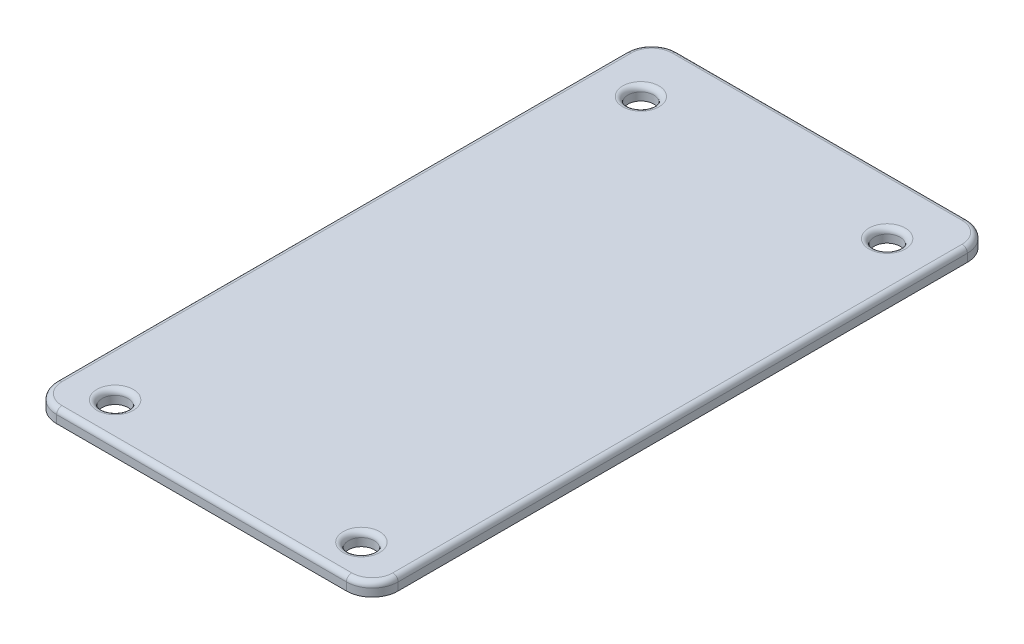
ISO-10303-21;
HEADER;
FILE_DESCRIPTION(('STEP AP214'),'2;1');
FILE_NAME('part.step','',(''),(''),'','','');
FILE_SCHEMA(('AUTOMOTIVE_DESIGN { 1 0 10303 214 1 1 1 1 }'));
ENDSEC;
DATA;
#1=APPLICATION_CONTEXT('core data for automotive mechanical design processes');
#2=APPLICATION_PROTOCOL_DEFINITION('international standard','automotive_design',2000,#1);
#3=PRODUCT_CONTEXT('',#1,'mechanical');
#4=PRODUCT('Part','Part','',(#3));
#5=PRODUCT_RELATED_PRODUCT_CATEGORY('part','',(#4));
#6=PRODUCT_DEFINITION_FORMATION('','',#4);
#7=PRODUCT_DEFINITION_CONTEXT('part definition',#1,'design');
#8=PRODUCT_DEFINITION('design','',#6,#7);
#9=PRODUCT_DEFINITION_SHAPE('','',#8);
#10=(LENGTH_UNIT() NAMED_UNIT(*) SI_UNIT(.MILLI.,.METRE.));
#11=(NAMED_UNIT(*) PLANE_ANGLE_UNIT() SI_UNIT($,.RADIAN.));
#12=(NAMED_UNIT(*) SI_UNIT($,.STERADIAN.) SOLID_ANGLE_UNIT());
#13=UNCERTAINTY_MEASURE_WITH_UNIT(LENGTH_MEASURE(1.E-05),#10,'distance_accuracy_value','');
#14=(GEOMETRIC_REPRESENTATION_CONTEXT(3) GLOBAL_UNCERTAINTY_ASSIGNED_CONTEXT((#13)) GLOBAL_UNIT_ASSIGNED_CONTEXT((#10,
#11,#12)) REPRESENTATION_CONTEXT('',''));
#15=CARTESIAN_POINT('',(0.,0.,0.));
#16=DIRECTION('',(0.,0.,1.));
#17=DIRECTION('',(1.,0.,0.));
#18=AXIS2_PLACEMENT_3D('',#15,#16,#17);
#19=CARTESIAN_POINT('',(0.489591657975623,1.27,-8.61171176999418));
#20=DIRECTION('',(1.,0.,0.));
#21=DIRECTION('',(0.,0.,-1.));
#22=AXIS2_PLACEMENT_3D('',#19,#20,#21);
#23=PLANE('',#22);
#24=DIRECTION('',(0.,-1.,0.));
#25=VECTOR('',#24,1.);
#26=CARTESIAN_POINT('',(0.48959165797563,1.27,48.8882881500058));
#27=LINE('',#26,#25);
#28=CARTESIAN_POINT('',(0.48959165797563,0.,48.8882881500058));
#29=VERTEX_POINT('',#28);
#30=CARTESIAN_POINT('',(0.48959165797563,0.762,48.8882881500058));
#31=VERTEX_POINT('',#30);
#32=EDGE_CURVE('E170',#29,#31,#27,.F.);
#33=ORIENTED_EDGE('',*,*,#32,.T.);
#34=DIRECTION('',(0.,0.,1.));
#35=VECTOR('',#34,1.);
#36=CARTESIAN_POINT('',(0.489591657975623,0.762,-6.11171168999418));
#37=LINE('',#36,#35);
#38=CARTESIAN_POINT('',(0.489591657975623,0.762,-6.11171168999418));
#39=VERTEX_POINT('',#38);
#40=EDGE_CURVE('E210',#31,#39,#37,.F.);
#41=ORIENTED_EDGE('',*,*,#40,.T.);
#42=DIRECTION('',(0.,-1.,0.));
#43=VECTOR('',#42,1.);
#44=CARTESIAN_POINT('',(0.489591657975623,1.27,-6.11171168999418));
#45=LINE('',#44,#43);
#46=CARTESIAN_POINT('',(0.489591657975623,0.,-6.11171168999418));
#47=VERTEX_POINT('',#46);
#48=EDGE_CURVE('E168',#39,#47,#45,.T.);
#49=ORIENTED_EDGE('',*,*,#48,.T.);
#50=DIRECTION('',(0.,0.,1.));
#51=VECTOR('',#50,1.);
#52=CARTESIAN_POINT('',(0.489591657975623,0.,-8.61171176999418));
#53=LINE('',#52,#51);
#54=EDGE_CURVE('E157',#47,#29,#53,.T.);
#55=ORIENTED_EDGE('',*,*,#54,.T.);
#56=EDGE_LOOP('',(#33,#41,#49,#55));
#57=FACE_BOUND('',#56,.T.);
#58=ADVANCED_FACE('F39',(#57),#23,.F.);
#59=CARTESIAN_POINT('',(0.48959165797563,1.27,51.3882882300058));
#60=DIRECTION('',(0.,0.,-1.));
#61=DIRECTION('',(-1.,0.,0.));
#62=AXIS2_PLACEMENT_3D('',#59,#60,#61);
#63=PLANE('',#62);
#64=DIRECTION('',(0.,-1.,0.));
#65=VECTOR('',#64,1.);
#66=CARTESIAN_POINT('',(30.9895915779756,1.27,51.3882882300058));
#67=LINE('',#66,#65);
#68=CARTESIAN_POINT('',(30.9895915779756,0.,51.3882882300058));
#69=VERTEX_POINT('',#68);
#70=CARTESIAN_POINT('',(30.9895915779756,0.762,51.3882882300058));
#71=VERTEX_POINT('',#70);
#72=EDGE_CURVE('E142',#69,#71,#67,.F.);
#73=ORIENTED_EDGE('',*,*,#72,.T.);
#74=DIRECTION('',(1.,0.,0.));
#75=VECTOR('',#74,1.);
#76=CARTESIAN_POINT('',(2.98959173797563,0.762,51.3882882300058));
#77=LINE('',#76,#75);
#78=CARTESIAN_POINT('',(2.98959173797563,0.762,51.3882882300058));
#79=VERTEX_POINT('',#78);
#80=EDGE_CURVE('E220',#71,#79,#77,.F.);
#81=ORIENTED_EDGE('',*,*,#80,.T.);
#82=DIRECTION('',(0.,-1.,0.));
#83=VECTOR('',#82,1.);
#84=CARTESIAN_POINT('',(2.98959173797563,1.27,51.3882882300058));
#85=LINE('',#84,#83);
#86=CARTESIAN_POINT('',(2.98959173797563,0.,51.3882882300058));
#87=VERTEX_POINT('',#86);
#88=EDGE_CURVE('E146',#79,#87,#85,.T.);
#89=ORIENTED_EDGE('',*,*,#88,.T.);
#90=DIRECTION('',(1.,0.,0.));
#91=VECTOR('',#90,1.);
#92=CARTESIAN_POINT('',(0.48959165797563,0.,51.3882882300058));
#93=LINE('',#92,#91);
#94=EDGE_CURVE('E153',#87,#69,#93,.T.);
#95=ORIENTED_EDGE('',*,*,#94,.T.);
#96=EDGE_LOOP('',(#73,#81,#89,#95));
#97=FACE_BOUND('',#96,.T.);
#98=ADVANCED_FACE('F329',(#97),#63,.F.);
#99=CARTESIAN_POINT('',(33.4895916579756,1.27,-8.61171176999418));
#100=DIRECTION('',(-1.,0.,0.));
#101=DIRECTION('',(0.,0.,1.));
#102=AXIS2_PLACEMENT_3D('',#99,#100,#101);
#103=PLANE('',#102);
#104=DIRECTION('',(0.,-1.,0.));
#105=VECTOR('',#104,1.);
#106=CARTESIAN_POINT('',(33.4895916579756,1.27,-6.11171168999418));
#107=LINE('',#106,#105);
#108=CARTESIAN_POINT('',(33.4895916579756,0.,-6.11171168999418));
#109=VERTEX_POINT('',#108);
#110=CARTESIAN_POINT('',(33.4895916579756,0.762,-6.11171168999418));
#111=VERTEX_POINT('',#110);
#112=EDGE_CURVE('E138',#109,#111,#107,.F.);
#113=ORIENTED_EDGE('',*,*,#112,.T.);
#114=DIRECTION('',(0.,0.,-1.));
#115=VECTOR('',#114,1.);
#116=CARTESIAN_POINT('',(33.4895916579756,0.762,48.8882881500058));
#117=LINE('',#116,#115);
#118=CARTESIAN_POINT('',(33.4895916579756,0.762,48.8882881500058));
#119=VERTEX_POINT('',#118);
#120=EDGE_CURVE('E64',#111,#119,#117,.F.);
#121=ORIENTED_EDGE('',*,*,#120,.T.);
#122=DIRECTION('',(0.,-1.,0.));
#123=VECTOR('',#122,1.);
#124=CARTESIAN_POINT('',(33.4895916579756,1.27,48.8882881500058));
#125=LINE('',#124,#123);
#126=CARTESIAN_POINT('',(33.4895916579756,0.,48.8882881500058));
#127=VERTEX_POINT('',#126);
#128=EDGE_CURVE('E130',#119,#127,#125,.T.);
#129=ORIENTED_EDGE('',*,*,#128,.T.);
#130=DIRECTION('',(0.,0.,-1.));
#131=VECTOR('',#130,1.);
#132=CARTESIAN_POINT('',(33.4895916579756,0.,-8.61171176999418));
#133=LINE('',#132,#131);
#134=EDGE_CURVE('E134',#127,#109,#133,.T.);
#135=ORIENTED_EDGE('',*,*,#134,.T.);
#136=EDGE_LOOP('',(#113,#121,#129,#135));
#137=FACE_BOUND('',#136,.T.);
#138=ADVANCED_FACE('F132',(#137),#103,.F.);
#139=CARTESIAN_POINT('',(0.489591657975623,1.27,-8.61171176999418));
#140=DIRECTION('',(0.,0.,1.));
#141=DIRECTION('',(1.,0.,0.));
#142=AXIS2_PLACEMENT_3D('',#139,#140,#141);
#143=PLANE('',#142);
#144=DIRECTION('',(0.,-1.,0.));
#145=VECTOR('',#144,1.);
#146=CARTESIAN_POINT('',(2.98959173797562,1.27,-8.61171176999418));
#147=LINE('',#146,#145);
#148=CARTESIAN_POINT('',(2.98959173797562,0.,-8.61171176999418));
#149=VERTEX_POINT('',#148);
#150=CARTESIAN_POINT('',(2.98959173797562,0.762,-8.61171176999418));
#151=VERTEX_POINT('',#150);
#152=EDGE_CURVE('E175',#149,#151,#147,.F.);
#153=ORIENTED_EDGE('',*,*,#152,.T.);
#154=DIRECTION('',(-1.,0.,0.));
#155=VECTOR('',#154,1.);
#156=CARTESIAN_POINT('',(30.9895915779756,0.762,-8.61171176999418));
#157=LINE('',#156,#155);
#158=CARTESIAN_POINT('',(30.9895915779756,0.762,-8.61171176999418));
#159=VERTEX_POINT('',#158);
#160=EDGE_CURVE('E214',#151,#159,#157,.F.);
#161=ORIENTED_EDGE('',*,*,#160,.T.);
#162=DIRECTION('',(0.,-1.,0.));
#163=VECTOR('',#162,1.);
#164=CARTESIAN_POINT('',(30.9895915779756,1.27,-8.61171176999418));
#165=LINE('',#164,#163);
#166=CARTESIAN_POINT('',(30.9895915779756,0.,-8.61171176999418));
#167=VERTEX_POINT('',#166);
#168=EDGE_CURVE('E173',#159,#167,#165,.T.);
#169=ORIENTED_EDGE('',*,*,#168,.T.);
#170=DIRECTION('',(-1.,0.,0.));
#171=VECTOR('',#170,1.);
#172=CARTESIAN_POINT('',(0.489591657975623,0.,-8.61171176999418));
#173=LINE('',#172,#171);
#174=EDGE_CURVE('E152',#167,#149,#173,.T.);
#175=ORIENTED_EDGE('',*,*,#174,.T.);
#176=EDGE_LOOP('',(#153,#161,#169,#175));
#177=FACE_BOUND('',#176,.T.);
#178=ADVANCED_FACE('F310',(#177),#143,.F.);
#179=CARTESIAN_POINT('',(0.,1.27,0.));
#180=DIRECTION('',(0.,1.,0.));
#181=DIRECTION('',(0.,0.,1.));
#182=AXIS2_PLACEMENT_3D('',#179,#180,#181);
#183=PLANE('',#182);
#184=DIRECTION('',(0.,0.,1.));
#185=VECTOR('',#184,1.);
#186=CARTESIAN_POINT('',(0.99759165797563,1.27,48.8882881500058));
#187=LINE('',#186,#185);
#188=CARTESIAN_POINT('',(0.997591657975623,1.27,-6.11171168999418));
#189=VERTEX_POINT('',#188);
#190=CARTESIAN_POINT('',(0.99759165797563,1.27,48.8882881500058));
#191=VERTEX_POINT('',#190);
#192=EDGE_CURVE('E202',#189,#191,#187,.T.);
#193=ORIENTED_EDGE('',*,*,#192,.T.);
#194=CARTESIAN_POINT('',(2.98959173797563,1.27,48.8882881500058));
#195=DIRECTION('',(0.,1.,0.));
#196=DIRECTION('',(0.,0.,1.));
#197=AXIS2_PLACEMENT_3D('',#194,#195,#196);
#198=CIRCLE('',#197,1.99200008);
#199=CARTESIAN_POINT('',(2.98959173797563,1.27,50.8802882300058));
#200=VERTEX_POINT('',#199);
#201=EDGE_CURVE('E204',#191,#200,#198,.T.);
#202=ORIENTED_EDGE('',*,*,#201,.T.);
#203=DIRECTION('',(1.,0.,0.));
#204=VECTOR('',#203,1.);
#205=CARTESIAN_POINT('',(30.9895915779756,1.27,50.8802882300058));
#206=LINE('',#205,#204);
#207=CARTESIAN_POINT('',(30.9895915779756,1.27,50.8802882300058));
#208=VERTEX_POINT('',#207);
#209=EDGE_CURVE('E190',#200,#208,#206,.T.);
#210=ORIENTED_EDGE('',*,*,#209,.T.);
#211=CARTESIAN_POINT('',(30.9895915779756,1.27,48.8882881500058));
#212=DIRECTION('',(0.,1.,0.));
#213=DIRECTION('',(0.,0.,1.));
#214=AXIS2_PLACEMENT_3D('',#211,#212,#213);
#215=CIRCLE('',#214,1.99200008);
#216=CARTESIAN_POINT('',(32.9815916579756,1.27,48.8882881500058));
#217=VERTEX_POINT('',#216);
#218=EDGE_CURVE('E192',#208,#217,#215,.T.);
#219=ORIENTED_EDGE('',*,*,#218,.T.);
#220=DIRECTION('',(0.,0.,-1.));
#221=VECTOR('',#220,1.);
#222=CARTESIAN_POINT('',(32.9815916579756,1.27,-6.11171168999418));
#223=LINE('',#222,#221);
#224=CARTESIAN_POINT('',(32.9815916579756,1.27,-6.11171168999418));
#225=VERTEX_POINT('',#224);
#226=EDGE_CURVE('E194',#217,#225,#223,.T.);
#227=ORIENTED_EDGE('',*,*,#226,.T.);
#228=CARTESIAN_POINT('',(30.9895915779756,1.27,-6.11171168999418));
#229=DIRECTION('',(0.,1.,0.));
#230=DIRECTION('',(0.,0.,1.));
#231=AXIS2_PLACEMENT_3D('',#228,#229,#230);
#232=CIRCLE('',#231,1.99200008);
#233=CARTESIAN_POINT('',(30.9895915779756,1.27,-8.10371176999418));
#234=VERTEX_POINT('',#233);
#235=EDGE_CURVE('E196',#225,#234,#232,.T.);
#236=ORIENTED_EDGE('',*,*,#235,.T.);
#237=DIRECTION('',(-1.,0.,0.));
#238=VECTOR('',#237,1.);
#239=CARTESIAN_POINT('',(2.98959173797562,1.27,-8.10371176999418));
#240=LINE('',#239,#238);
#241=CARTESIAN_POINT('',(2.98959173797562,1.27,-8.10371176999418));
#242=VERTEX_POINT('',#241);
#243=EDGE_CURVE('E198',#234,#242,#240,.T.);
#244=ORIENTED_EDGE('',*,*,#243,.T.);
#245=CARTESIAN_POINT('',(2.98959173797562,1.27,-6.11171168999418));
#246=DIRECTION('',(0.,1.,0.));
#247=DIRECTION('',(0.,0.,1.));
#248=AXIS2_PLACEMENT_3D('',#245,#246,#247);
#249=CIRCLE('',#248,1.99200008);
#250=EDGE_CURVE('E200',#242,#189,#249,.T.);
#251=ORIENTED_EDGE('',*,*,#250,.T.);
#252=EDGE_LOOP('',(#193,#202,#210,#219,#227,#236,#244,#251));
#253=FACE_BOUND('',#252,.T.);
#254=CARTESIAN_POINT('',(5.09387649901782,1.27,-2.96171176999418));
#255=DIRECTION('',(0.,1.,0.));
#256=DIRECTION('',(0.,0.,1.));
#257=AXIS2_PLACEMENT_3D('',#254,#255,#256);
#258=CIRCLE('',#257,1.7537151589578);
#259=CARTESIAN_POINT('',(5.09387649901782,1.27,-1.20799661103638));
#260=VERTEX_POINT('',#259);
#261=EDGE_CURVE('E187',#260,#260,#258,.F.);
#262=ORIENTED_EDGE('',*,*,#261,.T.);
#263=EDGE_LOOP('',(#262));
#264=FACE_BOUND('',#263,.T.);
#265=CARTESIAN_POINT('',(28.8895916579809,1.27,47.8382882300013));
#266=DIRECTION('',(0.,1.,0.));
#267=DIRECTION('',(0.,0.,1.));
#268=AXIS2_PLACEMENT_3D('',#265,#266,#267);
#269=CIRCLE('',#268,1.75799999999387);
#270=CARTESIAN_POINT('',(28.8895916579809,1.27,49.5962882299952));
#271=VERTEX_POINT('',#270);
#272=EDGE_CURVE('E184',#271,#271,#269,.F.);
#273=ORIENTED_EDGE('',*,*,#272,.T.);
#274=EDGE_LOOP('',(#273));
#275=FACE_BOUND('',#274,.T.);
#276=CARTESIAN_POINT('',(5.08959165796952,1.27,47.8382882300013));
#277=DIRECTION('',(0.,1.,0.));
#278=DIRECTION('',(0.,0.,1.));
#279=AXIS2_PLACEMENT_3D('',#276,#277,#278);
#280=CIRCLE('',#279,1.75799999999616);
#281=CARTESIAN_POINT('',(5.08959165796952,1.27,49.5962882299975));
#282=VERTEX_POINT('',#281);
#283=EDGE_CURVE('E181',#282,#282,#280,.F.);
#284=ORIENTED_EDGE('',*,*,#283,.T.);
#285=EDGE_LOOP('',(#284));
#286=FACE_BOUND('',#285,.T.);
#287=CARTESIAN_POINT('',(28.8895916579756,1.27,-2.96171176999418));
#288=DIRECTION('',(0.,1.,0.));
#289=DIRECTION('',(0.,0.,1.));
#290=AXIS2_PLACEMENT_3D('',#287,#288,#289);
#291=CIRCLE('',#290,1.758);
#292=CARTESIAN_POINT('',(28.8895916579756,1.27,-1.20371176999418));
#293=VERTEX_POINT('',#292);
#294=EDGE_CURVE('E178',#293,#293,#291,.F.);
#295=ORIENTED_EDGE('',*,*,#294,.T.);
#296=EDGE_LOOP('',(#295));
#297=FACE_BOUND('',#296,.T.);
#298=ADVANCED_FACE('F293',(#253,#264,#275,#286,#297),#183,.T.);
#299=CARTESIAN_POINT('',(0.,0.,0.));
#300=DIRECTION('',(0.,1.,0.));
#301=DIRECTION('',(0.,0.,1.));
#302=AXIS2_PLACEMENT_3D('',#299,#300,#301);
#303=PLANE('',#302);
#304=CARTESIAN_POINT('',(28.8895916579756,0.,-2.96171176999418));
#305=DIRECTION('',(0.,1.,0.));
#306=DIRECTION('',(0.,0.,1.));
#307=AXIS2_PLACEMENT_3D('',#304,#305,#306);
#308=CIRCLE('',#307,1.25);
#309=CARTESIAN_POINT('',(28.8895916579756,0.,-1.71171176999418));
#310=VERTEX_POINT('',#309);
#311=EDGE_CURVE('E262',#310,#310,#308,.F.);
#312=ORIENTED_EDGE('',*,*,#311,.F.);
#313=EDGE_LOOP('',(#312));
#314=FACE_BOUND('',#313,.T.);
#315=CARTESIAN_POINT('',(5.08959165796952,0.,47.8382882300013));
#316=DIRECTION('',(0.,1.,0.));
#317=DIRECTION('',(0.,0.,1.));
#318=AXIS2_PLACEMENT_3D('',#315,#316,#317);
#319=CIRCLE('',#318,1.24999999999616);
#320=CARTESIAN_POINT('',(5.08959165796952,0.,49.0882882299975));
#321=VERTEX_POINT('',#320);
#322=EDGE_CURVE('E257',#321,#321,#319,.F.);
#323=ORIENTED_EDGE('',*,*,#322,.F.);
#324=EDGE_LOOP('',(#323));
#325=FACE_BOUND('',#324,.T.);
#326=CARTESIAN_POINT('',(28.8895916579809,0.,47.8382882300013));
#327=DIRECTION('',(0.,1.,0.));
#328=DIRECTION('',(0.,0.,1.));
#329=AXIS2_PLACEMENT_3D('',#326,#327,#328);
#330=CIRCLE('',#329,1.24999999999387);
#331=CARTESIAN_POINT('',(28.8895916579809,0.,49.0882882299952));
#332=VERTEX_POINT('',#331);
#333=EDGE_CURVE('E251',#332,#332,#330,.F.);
#334=ORIENTED_EDGE('',*,*,#333,.F.);
#335=EDGE_LOOP('',(#334));
#336=FACE_BOUND('',#335,.T.);
#337=CARTESIAN_POINT('',(5.09387649901782,0.,-2.96171176999418));
#338=DIRECTION('',(0.,1.,0.));
#339=DIRECTION('',(0.,0.,1.));
#340=AXIS2_PLACEMENT_3D('',#337,#338,#339);
#341=CIRCLE('',#340,1.2457151589578);
#342=CARTESIAN_POINT('',(5.09387649901782,0.,-1.71599661103638));
#343=VERTEX_POINT('',#342);
#344=EDGE_CURVE('E266',#343,#343,#341,.F.);
#345=ORIENTED_EDGE('',*,*,#344,.F.);
#346=EDGE_LOOP('',(#345));
#347=FACE_BOUND('',#346,.T.);
#348=ORIENTED_EDGE('',*,*,#134,.F.);
#349=CARTESIAN_POINT('',(30.9895915779756,0.,48.8882881500058));
#350=DIRECTION('',(0.,1.,0.));
#351=DIRECTION('',(0.,0.,1.));
#352=AXIS2_PLACEMENT_3D('',#349,#350,#351);
#353=CIRCLE('',#352,2.50000008);
#354=EDGE_CURVE('E140',#127,#69,#353,.F.);
#355=ORIENTED_EDGE('',*,*,#354,.T.);
#356=ORIENTED_EDGE('',*,*,#94,.F.);
#357=CARTESIAN_POINT('',(2.98959173797563,0.,48.8882881500058));
#358=DIRECTION('',(0.,1.,0.));
#359=DIRECTION('',(0.,0.,1.));
#360=AXIS2_PLACEMENT_3D('',#357,#358,#359);
#361=CIRCLE('',#360,2.50000008);
#362=EDGE_CURVE('E147',#87,#29,#361,.F.);
#363=ORIENTED_EDGE('',*,*,#362,.T.);
#364=ORIENTED_EDGE('',*,*,#54,.F.);
#365=CARTESIAN_POINT('',(2.98959173797562,0.,-6.11171168999418));
#366=DIRECTION('',(0.,1.,0.));
#367=DIRECTION('',(0.,0.,1.));
#368=AXIS2_PLACEMENT_3D('',#365,#366,#367);
#369=CIRCLE('',#368,2.50000008);
#370=EDGE_CURVE('E163',#47,#149,#369,.F.);
#371=ORIENTED_EDGE('',*,*,#370,.T.);
#372=ORIENTED_EDGE('',*,*,#174,.F.);
#373=CARTESIAN_POINT('',(30.9895915779756,0.,-6.11171168999418));
#374=DIRECTION('',(0.,1.,0.));
#375=DIRECTION('',(0.,0.,1.));
#376=AXIS2_PLACEMENT_3D('',#373,#374,#375);
#377=CIRCLE('',#376,2.50000008);
#378=EDGE_CURVE('E137',#167,#109,#377,.F.);
#379=ORIENTED_EDGE('',*,*,#378,.T.);
#380=EDGE_LOOP('',(#348,#355,#356,#363,#364,#371,#372,#379));
#381=FACE_BOUND('',#380,.T.);
#382=ADVANCED_FACE('F149',(#314,#325,#336,#347,#381),#303,.F.);
#383=CARTESIAN_POINT('',(5.09387649901782,-0.000999999999999916,-2.96171176999418));
#384=DIRECTION('',(0.,1.,0.));
#385=DIRECTION('',(0.,0.,1.));
#386=AXIS2_PLACEMENT_3D('',#383,#384,#385);
#387=CYLINDRICAL_SURFACE('',#386,1.2457151589578);
#388=CARTESIAN_POINT('',(5.09387649901782,0.762,-2.96171176999418));
#389=DIRECTION('',(0.,1.,0.));
#390=DIRECTION('',(0.,0.,1.));
#391=AXIS2_PLACEMENT_3D('',#388,#389,#390);
#392=CIRCLE('',#391,1.2457151589578);
#393=CARTESIAN_POINT('',(5.09387649901782,0.762,-1.71599661103638));
#394=VERTEX_POINT('',#393);
#395=EDGE_CURVE('E222',#394,#394,#392,.T.);
#396=ORIENTED_EDGE('',*,*,#395,.T.);
#397=EDGE_LOOP('',(#396));
#398=FACE_BOUND('',#397,.T.);
#399=ORIENTED_EDGE('',*,*,#344,.T.);
#400=EDGE_LOOP('',(#399));
#401=FACE_BOUND('',#400,.T.);
#402=ADVANCED_FACE('F479',(#398,#401),#387,.F.);
#403=CARTESIAN_POINT('',(28.8895916579809,-0.000999999999999916,47.8382882300013));
#404=DIRECTION('',(0.,1.,0.));
#405=DIRECTION('',(0.,0.,1.));
#406=AXIS2_PLACEMENT_3D('',#403,#404,#405);
#407=CYLINDRICAL_SURFACE('',#406,1.24999999999387);
#408=CARTESIAN_POINT('',(28.8895916579809,0.762,47.8382882300013));
#409=DIRECTION('',(0.,1.,0.));
#410=DIRECTION('',(0.,0.,1.));
#411=AXIS2_PLACEMENT_3D('',#408,#409,#410);
#412=CIRCLE('',#411,1.24999999999387);
#413=CARTESIAN_POINT('',(28.8895916579809,0.762,49.0882882299952));
#414=VERTEX_POINT('',#413);
#415=EDGE_CURVE('E225',#414,#414,#412,.T.);
#416=ORIENTED_EDGE('',*,*,#415,.T.);
#417=EDGE_LOOP('',(#416));
#418=FACE_BOUND('',#417,.T.);
#419=ORIENTED_EDGE('',*,*,#333,.T.);
#420=EDGE_LOOP('',(#419));
#421=FACE_BOUND('',#420,.T.);
#422=ADVANCED_FACE('F470',(#418,#421),#407,.F.);
#423=CARTESIAN_POINT('',(5.08959165796952,-0.000999999999999916,47.8382882300013));
#424=DIRECTION('',(0.,1.,0.));
#425=DIRECTION('',(0.,0.,1.));
#426=AXIS2_PLACEMENT_3D('',#423,#424,#425);
#427=CYLINDRICAL_SURFACE('',#426,1.24999999999616);
#428=CARTESIAN_POINT('',(5.08959165796952,0.762,47.8382882300013));
#429=DIRECTION('',(0.,1.,0.));
#430=DIRECTION('',(0.,0.,1.));
#431=AXIS2_PLACEMENT_3D('',#428,#429,#430);
#432=CIRCLE('',#431,1.24999999999616);
#433=CARTESIAN_POINT('',(5.08959165796952,0.762,49.0882882299975));
#434=VERTEX_POINT('',#433);
#435=EDGE_CURVE('E48',#434,#434,#432,.T.);
#436=ORIENTED_EDGE('',*,*,#435,.T.);
#437=EDGE_LOOP('',(#436));
#438=FACE_BOUND('',#437,.T.);
#439=ORIENTED_EDGE('',*,*,#322,.T.);
#440=EDGE_LOOP('',(#439));
#441=FACE_BOUND('',#440,.T.);
#442=ADVANCED_FACE('F461',(#438,#441),#427,.F.);
#443=CARTESIAN_POINT('',(28.8895916579756,-0.000999999999999916,-2.96171176999418));
#444=DIRECTION('',(0.,1.,0.));
#445=DIRECTION('',(0.,0.,1.));
#446=AXIS2_PLACEMENT_3D('',#443,#444,#445);
#447=CYLINDRICAL_SURFACE('',#446,1.25);
#448=CARTESIAN_POINT('',(28.8895916579756,0.762,-2.96171176999418));
#449=DIRECTION('',(0.,1.,0.));
#450=DIRECTION('',(0.,0.,1.));
#451=AXIS2_PLACEMENT_3D('',#448,#449,#450);
#452=CIRCLE('',#451,1.25);
#453=CARTESIAN_POINT('',(28.8895916579756,0.762,-1.71171176999418));
#454=VERTEX_POINT('',#453);
#455=EDGE_CURVE('E11',#454,#454,#452,.T.);
#456=ORIENTED_EDGE('',*,*,#455,.T.);
#457=EDGE_LOOP('',(#456));
#458=FACE_BOUND('',#457,.T.);
#459=ORIENTED_EDGE('',*,*,#311,.T.);
#460=EDGE_LOOP('',(#459));
#461=FACE_BOUND('',#460,.T.);
#462=ADVANCED_FACE('F341',(#458,#461),#447,.F.);
#463=CARTESIAN_POINT('',(30.9895915779756,1.27,48.8882881500058));
#464=DIRECTION('',(0.,-1.,0.));
#465=DIRECTION('',(0.,0.,-1.));
#466=AXIS2_PLACEMENT_3D('',#463,#464,#465);
#467=CYLINDRICAL_SURFACE('',#466,2.50000008);
#468=ORIENTED_EDGE('',*,*,#128,.F.);
#469=CARTESIAN_POINT('',(30.9895915779756,0.762,48.8882881500058));
#470=DIRECTION('',(0.,1.,0.));
#471=DIRECTION('',(0.,0.,1.));
#472=AXIS2_PLACEMENT_3D('',#469,#470,#471);
#473=CIRCLE('',#472,2.50000008);
#474=EDGE_CURVE('E56',#119,#71,#473,.F.);
#475=ORIENTED_EDGE('',*,*,#474,.T.);
#476=ORIENTED_EDGE('',*,*,#72,.F.);
#477=ORIENTED_EDGE('',*,*,#354,.F.);
#478=EDGE_LOOP('',(#468,#475,#476,#477));
#479=FACE_BOUND('',#478,.T.);
#480=ADVANCED_FACE('F141',(#479),#467,.T.);
#481=CARTESIAN_POINT('',(2.98959173797563,1.27,48.8882881500058));
#482=DIRECTION('',(0.,-1.,0.));
#483=DIRECTION('',(0.,0.,-1.));
#484=AXIS2_PLACEMENT_3D('',#481,#482,#483);
#485=CYLINDRICAL_SURFACE('',#484,2.50000008);
#486=ORIENTED_EDGE('',*,*,#88,.F.);
#487=CARTESIAN_POINT('',(2.98959173797563,0.762,48.8882881500058));
#488=DIRECTION('',(0.,1.,0.));
#489=DIRECTION('',(0.,0.,1.));
#490=AXIS2_PLACEMENT_3D('',#487,#488,#489);
#491=CIRCLE('',#490,2.50000008);
#492=EDGE_CURVE('E207',#79,#31,#491,.F.);
#493=ORIENTED_EDGE('',*,*,#492,.T.);
#494=ORIENTED_EDGE('',*,*,#32,.F.);
#495=ORIENTED_EDGE('',*,*,#362,.F.);
#496=EDGE_LOOP('',(#486,#493,#494,#495));
#497=FACE_BOUND('',#496,.T.);
#498=ADVANCED_FACE('F278',(#497),#485,.T.);
#499=CARTESIAN_POINT('',(2.98959173797562,1.27,-6.11171168999418));
#500=DIRECTION('',(0.,-1.,0.));
#501=DIRECTION('',(0.,0.,-1.));
#502=AXIS2_PLACEMENT_3D('',#499,#500,#501);
#503=CYLINDRICAL_SURFACE('',#502,2.50000008);
#504=ORIENTED_EDGE('',*,*,#48,.F.);
#505=CARTESIAN_POINT('',(2.98959173797562,0.762,-6.11171168999418));
#506=DIRECTION('',(0.,1.,0.));
#507=DIRECTION('',(0.,0.,1.));
#508=AXIS2_PLACEMENT_3D('',#505,#506,#507);
#509=CIRCLE('',#508,2.50000008);
#510=EDGE_CURVE('E212',#39,#151,#509,.F.);
#511=ORIENTED_EDGE('',*,*,#510,.T.);
#512=ORIENTED_EDGE('',*,*,#152,.F.);
#513=ORIENTED_EDGE('',*,*,#370,.F.);
#514=EDGE_LOOP('',(#504,#511,#512,#513));
#515=FACE_BOUND('',#514,.T.);
#516=ADVANCED_FACE('F302',(#515),#503,.T.);
#517=CARTESIAN_POINT('',(30.9895915779756,1.27,-6.11171168999418));
#518=DIRECTION('',(0.,-1.,0.));
#519=DIRECTION('',(0.,0.,-1.));
#520=AXIS2_PLACEMENT_3D('',#517,#518,#519);
#521=CYLINDRICAL_SURFACE('',#520,2.50000008);
#522=ORIENTED_EDGE('',*,*,#168,.F.);
#523=CARTESIAN_POINT('',(30.9895915779756,0.762,-6.11171168999418));
#524=DIRECTION('',(0.,1.,0.));
#525=DIRECTION('',(0.,0.,1.));
#526=AXIS2_PLACEMENT_3D('',#523,#524,#525);
#527=CIRCLE('',#526,2.50000008);
#528=EDGE_CURVE('E216',#159,#111,#527,.F.);
#529=ORIENTED_EDGE('',*,*,#528,.T.);
#530=ORIENTED_EDGE('',*,*,#112,.F.);
#531=ORIENTED_EDGE('',*,*,#378,.F.);
#532=EDGE_LOOP('',(#522,#529,#530,#531));
#533=FACE_BOUND('',#532,.T.);
#534=ADVANCED_FACE('F313',(#533),#521,.T.);
#535=CARTESIAN_POINT('',(30.9895915779756,0.762,-6.11171168999418));
#536=DIRECTION('',(0.,1.,0.));
#537=DIRECTION('',(0.,0.,1.));
#538=AXIS2_PLACEMENT_3D('',#535,#536,#537);
#539=TOROIDAL_SURFACE('',#538,1.99200008,0.508);
#540=CARTESIAN_POINT('',(32.9815916579756,0.762,-6.11171168999418));
#541=DIRECTION('',(0.,0.,1.));
#542=DIRECTION('',(1.,0.,0.));
#543=AXIS2_PLACEMENT_3D('',#540,#541,#542);
#544=CIRCLE('',#543,0.508);
#545=EDGE_CURVE('E245',#111,#225,#544,.T.);
#546=ORIENTED_EDGE('',*,*,#545,.F.);
#547=ORIENTED_EDGE('',*,*,#528,.F.);
#548=CARTESIAN_POINT('',(30.9895915779756,0.762,-8.10371176999418));
#549=DIRECTION('',(-1.,0.,0.));
#550=DIRECTION('',(0.,0.,1.));
#551=AXIS2_PLACEMENT_3D('',#548,#549,#550);
#552=CIRCLE('',#551,0.508);
#553=EDGE_CURVE('E43',#234,#159,#552,.T.);
#554=ORIENTED_EDGE('',*,*,#553,.F.);
#555=ORIENTED_EDGE('',*,*,#235,.F.);
#556=EDGE_LOOP('',(#546,#547,#554,#555));
#557=FACE_BOUND('',#556,.T.);
#558=ADVANCED_FACE('F315',(#557),#539,.T.);
#559=CARTESIAN_POINT('',(0.,0.762,-8.10371176999418));
#560=DIRECTION('',(1.,0.,0.));
#561=DIRECTION('',(0.,0.,-1.));
#562=AXIS2_PLACEMENT_3D('',#559,#560,#561);
#563=CYLINDRICAL_SURFACE('',#562,0.508);
#564=ORIENTED_EDGE('',*,*,#553,.T.);
#565=ORIENTED_EDGE('',*,*,#160,.F.);
#566=CARTESIAN_POINT('',(2.98959173797562,0.762,-8.10371176999418));
#567=DIRECTION('',(-1.,0.,0.));
#568=DIRECTION('',(0.,0.,1.));
#569=AXIS2_PLACEMENT_3D('',#566,#567,#568);
#570=CIRCLE('',#569,0.508);
#571=EDGE_CURVE('E243',#242,#151,#570,.T.);
#572=ORIENTED_EDGE('',*,*,#571,.F.);
#573=ORIENTED_EDGE('',*,*,#243,.F.);
#574=EDGE_LOOP('',(#564,#565,#572,#573));
#575=FACE_BOUND('',#574,.T.);
#576=ADVANCED_FACE('F307',(#575),#563,.T.);
#577=CARTESIAN_POINT('',(32.9815916579756,0.762,0.));
#578=DIRECTION('',(0.,0.,1.));
#579=DIRECTION('',(1.,0.,0.));
#580=AXIS2_PLACEMENT_3D('',#577,#578,#579);
#581=CYLINDRICAL_SURFACE('',#580,0.508);
#582=ORIENTED_EDGE('',*,*,#545,.T.);
#583=ORIENTED_EDGE('',*,*,#226,.F.);
#584=CARTESIAN_POINT('',(32.9815916579756,0.762,48.8882881500058));
#585=DIRECTION('',(0.,0.,1.));
#586=DIRECTION('',(1.,0.,0.));
#587=AXIS2_PLACEMENT_3D('',#584,#585,#586);
#588=CIRCLE('',#587,0.508);
#589=EDGE_CURVE('E240',#119,#217,#588,.T.);
#590=ORIENTED_EDGE('',*,*,#589,.F.);
#591=ORIENTED_EDGE('',*,*,#120,.F.);
#592=EDGE_LOOP('',(#582,#583,#590,#591));
#593=FACE_BOUND('',#592,.T.);
#594=ADVANCED_FACE('F317',(#593),#581,.T.);
#595=CARTESIAN_POINT('',(2.98959173797562,0.762,-6.11171168999418));
#596=DIRECTION('',(0.,1.,0.));
#597=DIRECTION('',(0.,0.,1.));
#598=AXIS2_PLACEMENT_3D('',#595,#596,#597);
#599=TOROIDAL_SURFACE('',#598,1.99200008,0.508);
#600=ORIENTED_EDGE('',*,*,#571,.T.);
#601=ORIENTED_EDGE('',*,*,#510,.F.);
#602=CARTESIAN_POINT('',(0.997591657975623,0.762,-6.11171168999418));
#603=DIRECTION('',(0.,0.,1.));
#604=DIRECTION('',(1.,0.,0.));
#605=AXIS2_PLACEMENT_3D('',#602,#603,#604);
#606=CIRCLE('',#605,0.508);
#607=EDGE_CURVE('E237',#189,#39,#606,.T.);
#608=ORIENTED_EDGE('',*,*,#607,.F.);
#609=ORIENTED_EDGE('',*,*,#250,.F.);
#610=EDGE_LOOP('',(#600,#601,#608,#609));
#611=FACE_BOUND('',#610,.T.);
#612=ADVANCED_FACE('F305',(#611),#599,.T.);
#613=CARTESIAN_POINT('',(30.9895915779756,0.762,48.8882881500058));
#614=DIRECTION('',(0.,1.,0.));
#615=DIRECTION('',(0.,0.,1.));
#616=AXIS2_PLACEMENT_3D('',#613,#614,#615);
#617=TOROIDAL_SURFACE('',#616,1.99200008,0.508);
#618=ORIENTED_EDGE('',*,*,#589,.T.);
#619=ORIENTED_EDGE('',*,*,#218,.F.);
#620=CARTESIAN_POINT('',(30.9895915779756,0.762,50.8802882300058));
#621=DIRECTION('',(-1.,0.,0.));
#622=DIRECTION('',(0.,0.,1.));
#623=AXIS2_PLACEMENT_3D('',#620,#621,#622);
#624=CIRCLE('',#623,0.508);
#625=EDGE_CURVE('E234',#71,#208,#624,.T.);
#626=ORIENTED_EDGE('',*,*,#625,.F.);
#627=ORIENTED_EDGE('',*,*,#474,.F.);
#628=EDGE_LOOP('',(#618,#619,#626,#627));
#629=FACE_BOUND('',#628,.T.);
#630=ADVANCED_FACE('F319',(#629),#617,.T.);
#631=CARTESIAN_POINT('',(0.997591657975624,0.762,0.));
#632=DIRECTION('',(0.,0.,-1.));
#633=DIRECTION('',(-1.,0.,0.));
#634=AXIS2_PLACEMENT_3D('',#631,#632,#633);
#635=CYLINDRICAL_SURFACE('',#634,0.508);
#636=ORIENTED_EDGE('',*,*,#607,.T.);
#637=ORIENTED_EDGE('',*,*,#40,.F.);
#638=CARTESIAN_POINT('',(0.99759165797563,0.762,48.8882881500058));
#639=DIRECTION('',(0.,0.,1.));
#640=DIRECTION('',(1.,0.,0.));
#641=AXIS2_PLACEMENT_3D('',#638,#639,#640);
#642=CIRCLE('',#641,0.508);
#643=EDGE_CURVE('E232',#191,#31,#642,.T.);
#644=ORIENTED_EDGE('',*,*,#643,.F.);
#645=ORIENTED_EDGE('',*,*,#192,.F.);
#646=EDGE_LOOP('',(#636,#637,#644,#645));
#647=FACE_BOUND('',#646,.T.);
#648=ADVANCED_FACE('F299',(#647),#635,.T.);
#649=CARTESIAN_POINT('',(0.,0.762,50.8802882300058));
#650=DIRECTION('',(-1.,0.,0.));
#651=DIRECTION('',(0.,0.,1.));
#652=AXIS2_PLACEMENT_3D('',#649,#650,#651);
#653=CYLINDRICAL_SURFACE('',#652,0.508);
#654=ORIENTED_EDGE('',*,*,#625,.T.);
#655=ORIENTED_EDGE('',*,*,#209,.F.);
#656=CARTESIAN_POINT('',(2.98959173797563,0.762,50.8802882300058));
#657=DIRECTION('',(-1.,0.,0.));
#658=DIRECTION('',(0.,0.,1.));
#659=AXIS2_PLACEMENT_3D('',#656,#657,#658);
#660=CIRCLE('',#659,0.508);
#661=EDGE_CURVE('E230',#79,#200,#660,.T.);
#662=ORIENTED_EDGE('',*,*,#661,.F.);
#663=ORIENTED_EDGE('',*,*,#80,.F.);
#664=EDGE_LOOP('',(#654,#655,#662,#663));
#665=FACE_BOUND('',#664,.T.);
#666=ADVANCED_FACE('F289',(#665),#653,.T.);
#667=CARTESIAN_POINT('',(2.98959173797563,0.762,48.8882881500058));
#668=DIRECTION('',(0.,1.,0.));
#669=DIRECTION('',(0.,0.,1.));
#670=AXIS2_PLACEMENT_3D('',#667,#668,#669);
#671=TOROIDAL_SURFACE('',#670,1.99200008,0.508);
#672=ORIENTED_EDGE('',*,*,#643,.T.);
#673=ORIENTED_EDGE('',*,*,#492,.F.);
#674=ORIENTED_EDGE('',*,*,#661,.T.);
#675=ORIENTED_EDGE('',*,*,#201,.F.);
#676=EDGE_LOOP('',(#672,#673,#674,#675));
#677=FACE_BOUND('',#676,.T.);
#678=ADVANCED_FACE('F282',(#677),#671,.T.);
#679=CARTESIAN_POINT('',(5.09387649901782,0.762,-2.96171176999418));
#680=DIRECTION('',(0.,1.,0.));
#681=DIRECTION('',(0.,0.,1.));
#682=AXIS2_PLACEMENT_3D('',#679,#680,#681);
#683=TOROIDAL_SURFACE('',#682,1.7537151589578,0.508);
#684=ORIENTED_EDGE('',*,*,#261,.F.);
#685=EDGE_LOOP('',(#684));
#686=FACE_BOUND('',#685,.T.);
#687=ORIENTED_EDGE('',*,*,#395,.F.);
#688=EDGE_LOOP('',(#687));
#689=FACE_BOUND('',#688,.T.);
#690=ADVANCED_FACE('F350',(#686,#689),#683,.T.);
#691=CARTESIAN_POINT('',(28.8895916579809,0.762,47.8382882300013));
#692=DIRECTION('',(0.,1.,0.));
#693=DIRECTION('',(0.,0.,1.));
#694=AXIS2_PLACEMENT_3D('',#691,#692,#693);
#695=TOROIDAL_SURFACE('',#694,1.75799999999387,0.508);
#696=ORIENTED_EDGE('',*,*,#272,.F.);
#697=EDGE_LOOP('',(#696));
#698=FACE_BOUND('',#697,.T.);
#699=ORIENTED_EDGE('',*,*,#415,.F.);
#700=EDGE_LOOP('',(#699));
#701=FACE_BOUND('',#700,.T.);
#702=ADVANCED_FACE('F368',(#698,#701),#695,.T.);
#703=CARTESIAN_POINT('',(5.08959165796952,0.762,47.8382882300013));
#704=DIRECTION('',(0.,1.,0.));
#705=DIRECTION('',(0.,0.,1.));
#706=AXIS2_PLACEMENT_3D('',#703,#704,#705);
#707=TOROIDAL_SURFACE('',#706,1.75799999999616,0.508);
#708=ORIENTED_EDGE('',*,*,#283,.F.);
#709=EDGE_LOOP('',(#708));
#710=FACE_BOUND('',#709,.T.);
#711=ORIENTED_EDGE('',*,*,#435,.F.);
#712=EDGE_LOOP('',(#711));
#713=FACE_BOUND('',#712,.T.);
#714=ADVANCED_FACE('F377',(#710,#713),#707,.T.);
#715=CARTESIAN_POINT('',(28.8895916579756,0.762,-2.96171176999418));
#716=DIRECTION('',(0.,1.,0.));
#717=DIRECTION('',(0.,0.,1.));
#718=AXIS2_PLACEMENT_3D('',#715,#716,#717);
#719=TOROIDAL_SURFACE('',#718,1.758,0.508);
#720=ORIENTED_EDGE('',*,*,#294,.F.);
#721=EDGE_LOOP('',(#720));
#722=FACE_BOUND('',#721,.T.);
#723=ORIENTED_EDGE('',*,*,#455,.F.);
#724=EDGE_LOOP('',(#723));
#725=FACE_BOUND('',#724,.T.);
#726=ADVANCED_FACE('F41',(#722,#725),#719,.T.);
#727=CLOSED_SHELL('',(#58,#98,#138,#178,#298,#382,#402,#422,#442,#462,#480,#498,#516,#534,#558,
#576,#594,#612,#630,#648,#666,#678,#690,#702,#714,#726));
#728=MANIFOLD_SOLID_BREP('B2',#727);
#729=ADVANCED_BREP_SHAPE_REPRESENTATION('',(#18,#728),#14);
#730=SHAPE_DEFINITION_REPRESENTATION(#9,#729);
ENDSEC;
END-ISO-10303-21;
